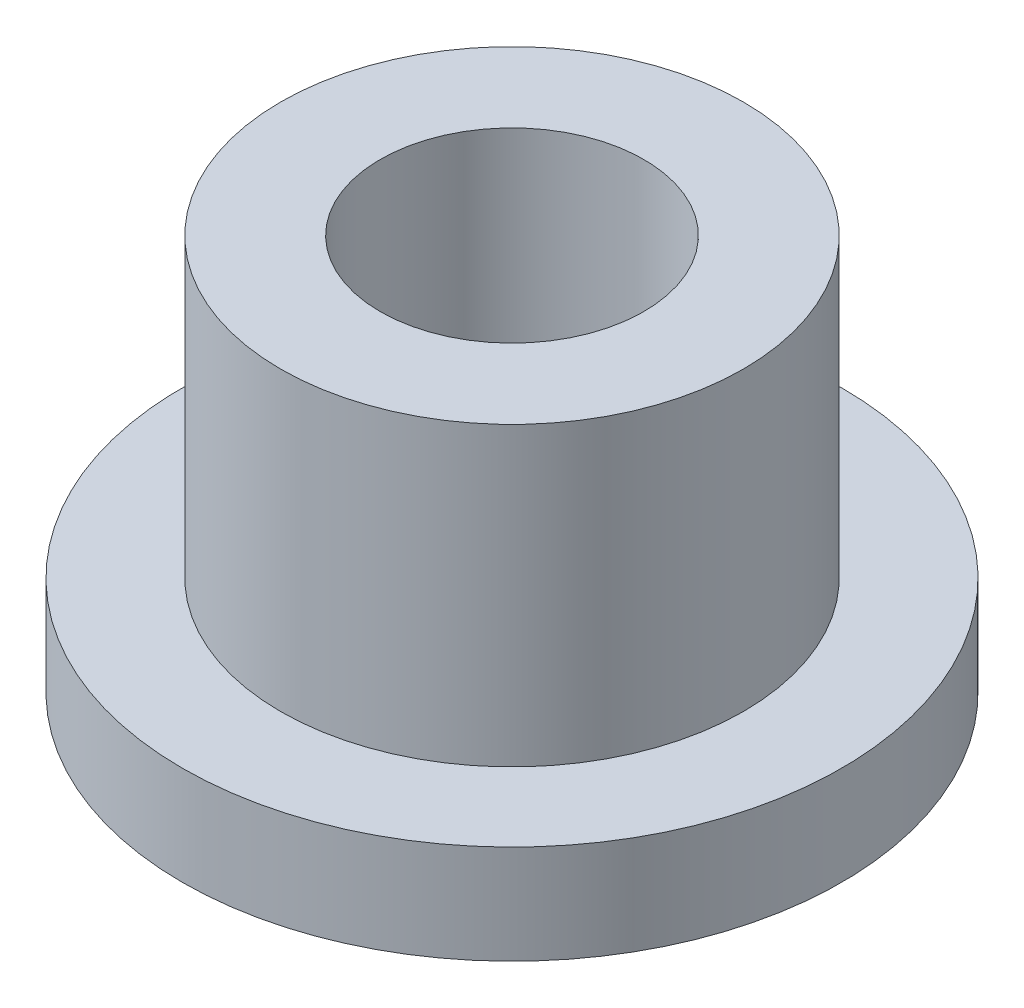
ISO-10303-21;
HEADER;
FILE_DESCRIPTION(('STEP AP214'),'2;1');
FILE_NAME('part.step','',(''),(''),'','','');
FILE_SCHEMA(('AUTOMOTIVE_DESIGN { 1 0 10303 214 1 1 1 1 }'));
ENDSEC;
DATA;
#1=APPLICATION_CONTEXT('core data for automotive mechanical design processes');
#2=APPLICATION_PROTOCOL_DEFINITION('international standard','automotive_design',2000,#1);
#3=PRODUCT_CONTEXT('',#1,'mechanical');
#4=PRODUCT('Part','Part','',(#3));
#5=PRODUCT_RELATED_PRODUCT_CATEGORY('part','',(#4));
#6=PRODUCT_DEFINITION_FORMATION('','',#4);
#7=PRODUCT_DEFINITION_CONTEXT('part definition',#1,'design');
#8=PRODUCT_DEFINITION('design','',#6,#7);
#9=PRODUCT_DEFINITION_SHAPE('','',#8);
#10=(LENGTH_UNIT() NAMED_UNIT(*) SI_UNIT(.MILLI.,.METRE.));
#11=(NAMED_UNIT(*) PLANE_ANGLE_UNIT() SI_UNIT($,.RADIAN.));
#12=(NAMED_UNIT(*) SI_UNIT($,.STERADIAN.) SOLID_ANGLE_UNIT());
#13=UNCERTAINTY_MEASURE_WITH_UNIT(LENGTH_MEASURE(1.E-05),#10,'distance_accuracy_value','');
#14=(GEOMETRIC_REPRESENTATION_CONTEXT(3) GLOBAL_UNCERTAINTY_ASSIGNED_CONTEXT((#13)) GLOBAL_UNIT_ASSIGNED_CONTEXT((#10,
#11,#12)) REPRESENTATION_CONTEXT('',''));
#15=CARTESIAN_POINT('',(0.,0.,0.));
#16=DIRECTION('',(0.,0.,1.));
#17=DIRECTION('',(1.,0.,0.));
#18=AXIS2_PLACEMENT_3D('',#15,#16,#17);
#19=CARTESIAN_POINT('',(0.,3.,0.));
#20=DIRECTION('',(0.,1.,0.));
#21=DIRECTION('',(0.,0.,1.));
#22=AXIS2_PLACEMENT_3D('',#19,#20,#21);
#23=PLANE('',#22);
#24=CARTESIAN_POINT('',(0.,3.,0.));
#25=DIRECTION('',(0.,1.,0.));
#26=DIRECTION('',(0.,0.,1.));
#27=AXIS2_PLACEMENT_3D('',#24,#25,#26);
#28=CIRCLE('',#27,3.51);
#29=CARTESIAN_POINT('',(0.,3.,3.51));
#30=VERTEX_POINT('',#29);
#31=EDGE_CURVE('E10',#30,#30,#28,.T.);
#32=ORIENTED_EDGE('',*,*,#31,.T.);
#33=EDGE_LOOP('',(#32));
#34=FACE_BOUND('',#33,.T.);
#35=CARTESIAN_POINT('',(0.,3.,0.));
#36=DIRECTION('',(0.,1.,0.));
#37=DIRECTION('',(0.,0.,1.));
#38=AXIS2_PLACEMENT_3D('',#35,#36,#37);
#39=CIRCLE('',#38,2.);
#40=CARTESIAN_POINT('',(0.,3.,2.));
#41=VERTEX_POINT('',#40);
#42=EDGE_CURVE('E37',#41,#41,#39,.T.);
#43=ORIENTED_EDGE('',*,*,#42,.F.);
#44=EDGE_LOOP('',(#43));
#45=FACE_BOUND('',#44,.T.);
#46=ADVANCED_FACE('F30',(#34,#45),#23,.T.);
#47=CARTESIAN_POINT('',(0.,3.,0.));
#48=DIRECTION('',(0.,-1.,0.));
#49=DIRECTION('',(0.,0.,-1.));
#50=AXIS2_PLACEMENT_3D('',#47,#48,#49);
#51=CYLINDRICAL_SURFACE('',#50,3.51);
#52=CARTESIAN_POINT('',(0.,-1.5,0.));
#53=DIRECTION('',(0.,1.,0.));
#54=DIRECTION('',(0.,0.,1.));
#55=AXIS2_PLACEMENT_3D('',#52,#53,#54);
#56=CIRCLE('',#55,3.51);
#57=CARTESIAN_POINT('',(0.,-1.5,3.51));
#58=VERTEX_POINT('',#57);
#59=EDGE_CURVE('E51',#58,#58,#56,.T.);
#60=ORIENTED_EDGE('',*,*,#59,.T.);
#61=EDGE_LOOP('',(#60));
#62=FACE_BOUND('',#61,.T.);
#63=ORIENTED_EDGE('',*,*,#31,.F.);
#64=EDGE_LOOP('',(#63));
#65=FACE_BOUND('',#64,.T.);
#66=ADVANCED_FACE('F32',(#62,#65),#51,.T.);
#67=CARTESIAN_POINT('',(0.,3.,0.));
#68=DIRECTION('',(0.,-1.,0.));
#69=DIRECTION('',(0.,0.,-1.));
#70=AXIS2_PLACEMENT_3D('',#67,#68,#69);
#71=CYLINDRICAL_SURFACE('',#70,2.);
#72=ORIENTED_EDGE('',*,*,#42,.T.);
#73=EDGE_LOOP('',(#72));
#74=FACE_BOUND('',#73,.T.);
#75=CARTESIAN_POINT('',(0.,-3.,0.));
#76=DIRECTION('',(0.,1.,0.));
#77=DIRECTION('',(0.,0.,1.));
#78=AXIS2_PLACEMENT_3D('',#75,#76,#77);
#79=CIRCLE('',#78,2.);
#80=CARTESIAN_POINT('',(0.,-3.,2.));
#81=VERTEX_POINT('',#80);
#82=EDGE_CURVE('E41',#81,#81,#79,.T.);
#83=ORIENTED_EDGE('',*,*,#82,.F.);
#84=EDGE_LOOP('',(#83));
#85=FACE_BOUND('',#84,.T.);
#86=ADVANCED_FACE('F71',(#74,#85),#71,.F.);
#87=CARTESIAN_POINT('',(0.,-3.,0.));
#88=DIRECTION('',(0.,1.,0.));
#89=DIRECTION('',(0.,0.,1.));
#90=AXIS2_PLACEMENT_3D('',#87,#88,#89);
#91=PLANE('',#90);
#92=ORIENTED_EDGE('',*,*,#82,.T.);
#93=EDGE_LOOP('',(#92));
#94=FACE_BOUND('',#93,.T.);
#95=CARTESIAN_POINT('',(0.,-3.,0.));
#96=DIRECTION('',(0.,1.,0.));
#97=DIRECTION('',(0.,0.,1.));
#98=AXIS2_PLACEMENT_3D('',#95,#96,#97);
#99=CIRCLE('',#98,5.);
#100=CARTESIAN_POINT('',(0.,-3.,5.));
#101=VERTEX_POINT('',#100);
#102=EDGE_CURVE('E48',#101,#101,#99,.T.);
#103=ORIENTED_EDGE('',*,*,#102,.F.);
#104=EDGE_LOOP('',(#103));
#105=FACE_BOUND('',#104,.T.);
#106=ADVANCED_FACE('F62',(#94,#105),#91,.F.);
#107=CARTESIAN_POINT('',(0.,-1.5,0.));
#108=DIRECTION('',(0.,1.,0.));
#109=DIRECTION('',(0.,0.,1.));
#110=AXIS2_PLACEMENT_3D('',#107,#108,#109);
#111=PLANE('',#110);
#112=CARTESIAN_POINT('',(0.,-1.5,0.));
#113=DIRECTION('',(0.,1.,0.));
#114=DIRECTION('',(0.,0.,1.));
#115=AXIS2_PLACEMENT_3D('',#112,#113,#114);
#116=CIRCLE('',#115,5.);
#117=CARTESIAN_POINT('',(0.,-1.5,5.));
#118=VERTEX_POINT('',#117);
#119=EDGE_CURVE('E45',#118,#118,#116,.T.);
#120=ORIENTED_EDGE('',*,*,#119,.T.);
#121=EDGE_LOOP('',(#120));
#122=FACE_BOUND('',#121,.T.);
#123=ORIENTED_EDGE('',*,*,#59,.F.);
#124=EDGE_LOOP('',(#123));
#125=FACE_BOUND('',#124,.T.);
#126=ADVANCED_FACE('F59',(#122,#125),#111,.T.);
#127=CARTESIAN_POINT('',(0.,-1.5,0.));
#128=DIRECTION('',(0.,-1.,0.));
#129=DIRECTION('',(0.,0.,-1.));
#130=AXIS2_PLACEMENT_3D('',#127,#128,#129);
#131=CYLINDRICAL_SURFACE('',#130,5.);
#132=ORIENTED_EDGE('',*,*,#119,.F.);
#133=EDGE_LOOP('',(#132));
#134=FACE_BOUND('',#133,.T.);
#135=ORIENTED_EDGE('',*,*,#102,.T.);
#136=EDGE_LOOP('',(#135));
#137=FACE_BOUND('',#136,.T.);
#138=ADVANCED_FACE('F61',(#134,#137),#131,.T.);
#139=CLOSED_SHELL('',(#46,#66,#86,#106,#126,#138));
#140=MANIFOLD_SOLID_BREP('B2',#139);
#141=ADVANCED_BREP_SHAPE_REPRESENTATION('',(#18,#140),#14);
#142=SHAPE_DEFINITION_REPRESENTATION(#9,#141);
ENDSEC;
END-ISO-10303-21;
